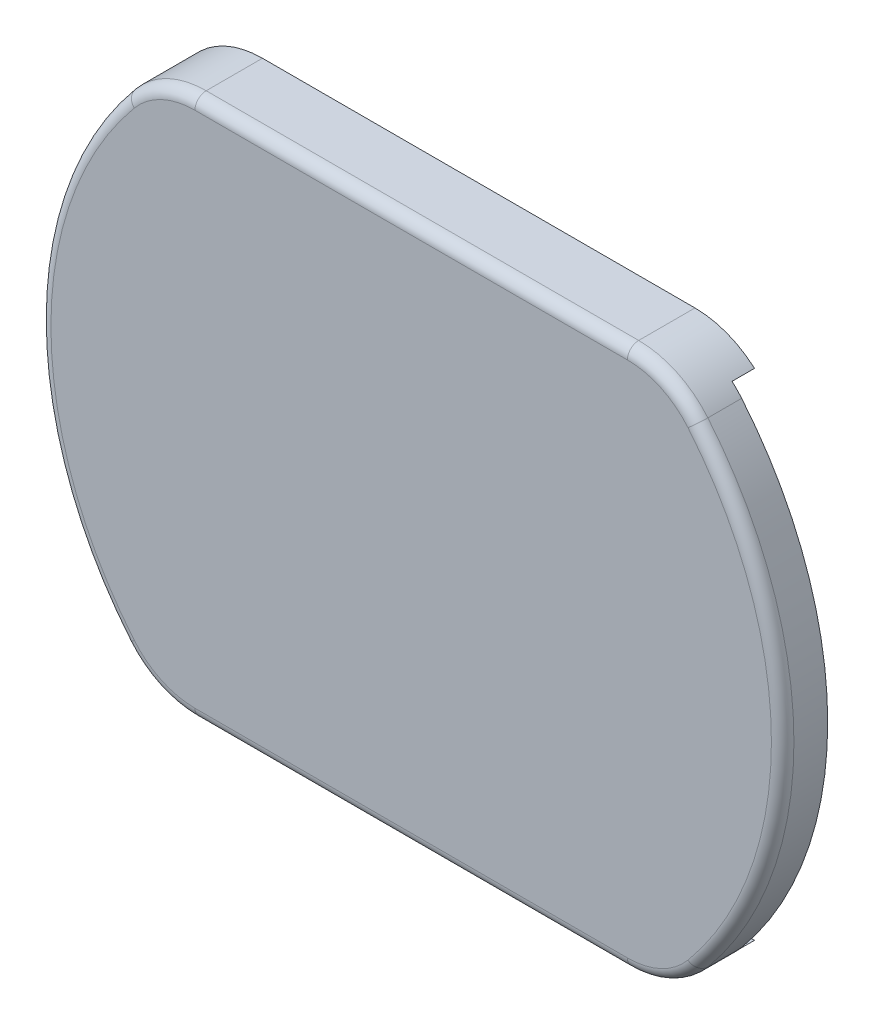
ISO-10303-21;
HEADER;
FILE_DESCRIPTION(('STEP AP214'),'2;1');
FILE_NAME('part.step','',(''),(''),'','','');
FILE_SCHEMA(('AUTOMOTIVE_DESIGN { 1 0 10303 214 1 1 1 1 }'));
ENDSEC;
DATA;
#1=APPLICATION_CONTEXT('core data for automotive mechanical design processes');
#2=APPLICATION_PROTOCOL_DEFINITION('international standard','automotive_design',2000,#1);
#3=PRODUCT_CONTEXT('',#1,'mechanical');
#4=PRODUCT('Part','Part','',(#3));
#5=PRODUCT_RELATED_PRODUCT_CATEGORY('part','',(#4));
#6=PRODUCT_DEFINITION_FORMATION('','',#4);
#7=PRODUCT_DEFINITION_CONTEXT('part definition',#1,'design');
#8=PRODUCT_DEFINITION('design','',#6,#7);
#9=PRODUCT_DEFINITION_SHAPE('','',#8);
#10=(LENGTH_UNIT() NAMED_UNIT(*) SI_UNIT(.MILLI.,.METRE.));
#11=(NAMED_UNIT(*) PLANE_ANGLE_UNIT() SI_UNIT($,.RADIAN.));
#12=(NAMED_UNIT(*) SI_UNIT($,.STERADIAN.) SOLID_ANGLE_UNIT());
#13=UNCERTAINTY_MEASURE_WITH_UNIT(LENGTH_MEASURE(1.E-05),#10,'distance_accuracy_value','');
#14=(GEOMETRIC_REPRESENTATION_CONTEXT(3) GLOBAL_UNCERTAINTY_ASSIGNED_CONTEXT((#13)) GLOBAL_UNIT_ASSIGNED_CONTEXT((#10,
#11,#12)) REPRESENTATION_CONTEXT('',''));
#15=CARTESIAN_POINT('',(0.,0.,0.));
#16=DIRECTION('',(0.,0.,1.));
#17=DIRECTION('',(1.,0.,0.));
#18=AXIS2_PLACEMENT_3D('',#15,#16,#17);
#19=CARTESIAN_POINT('',(9.60468635614927,8.,3.));
#20=DIRECTION('',(0.,0.,-1.));
#21=DIRECTION('',(-1.,0.,0.));
#22=AXIS2_PLACEMENT_3D('',#19,#20,#21);
#23=CYLINDRICAL_SURFACE('',#22,4.);
#24=DIRECTION('',(0.,0.,1.));
#25=VECTOR('',#24,1.);
#26=CARTESIAN_POINT('',(12.2504376672139,11.,0.));
#27=LINE('',#26,#25);
#28=CARTESIAN_POINT('',(12.2504376672139,11.,0.));
#29=VERTEX_POINT('',#28);
#30=CARTESIAN_POINT('',(12.2504376672139,11.,1.));
#31=VERTEX_POINT('',#30);
#32=EDGE_CURVE('E301',#29,#31,#27,.T.);
#33=ORIENTED_EDGE('',*,*,#32,.F.);
#34=CARTESIAN_POINT('',(9.60468635614927,8.,0.));
#35=DIRECTION('',(0.,0.,1.));
#36=DIRECTION('',(1.,0.,0.));
#37=AXIS2_PLACEMENT_3D('',#34,#35,#36);
#38=CIRCLE('',#37,4.);
#39=CARTESIAN_POINT('',(9.60468635614927,12.,0.));
#40=VERTEX_POINT('',#39);
#41=EDGE_CURVE('E325',#29,#40,#38,.T.);
#42=ORIENTED_EDGE('',*,*,#41,.T.);
#43=DIRECTION('',(0.,0.,-1.));
#44=VECTOR('',#43,1.);
#45=CARTESIAN_POINT('',(9.60468635614927,12.,3.));
#46=LINE('',#45,#44);
#47=CARTESIAN_POINT('',(9.60468635614927,12.,2.5));
#48=VERTEX_POINT('',#47);
#49=EDGE_CURVE('E342',#48,#40,#46,.T.);
#50=ORIENTED_EDGE('',*,*,#49,.F.);
#51=CARTESIAN_POINT('',(9.60468635614927,8.,2.5));
#52=DIRECTION('',(0.,0.,1.));
#53=DIRECTION('',(1.,0.,0.));
#54=AXIS2_PLACEMENT_3D('',#51,#52,#53);
#55=CIRCLE('',#54,4.);
#56=CARTESIAN_POINT('',(12.678185990117,10.56,2.5));
#57=VERTEX_POINT('',#56);
#58=EDGE_CURVE('E379',#48,#57,#55,.F.);
#59=ORIENTED_EDGE('',*,*,#58,.T.);
#60=DIRECTION('',(0.,0.,-1.));
#61=VECTOR('',#60,1.);
#62=CARTESIAN_POINT('',(12.678185990117,10.56,3.));
#63=LINE('',#62,#61);
#64=CARTESIAN_POINT('',(12.678185990117,10.56,1.));
#65=VERTEX_POINT('',#64);
#66=EDGE_CURVE('E345',#57,#65,#63,.T.);
#67=ORIENTED_EDGE('',*,*,#66,.T.);
#68=CARTESIAN_POINT('',(9.60468635614927,8.,1.));
#69=DIRECTION('',(0.,0.,1.));
#70=DIRECTION('',(1.,0.,0.));
#71=AXIS2_PLACEMENT_3D('',#68,#69,#70);
#72=CIRCLE('',#71,4.);
#73=EDGE_CURVE('E307',#65,#31,#72,.T.);
#74=ORIENTED_EDGE('',*,*,#73,.T.);
#75=EDGE_LOOP('',(#33,#42,#50,#59,#67,#74));
#76=FACE_BOUND('',#75,.T.);
#77=ADVANCED_FACE('F34',(#76),#23,.T.);
#78=CARTESIAN_POINT('',(-9.60468635614927,-8.,3.));
#79=DIRECTION('',(0.,0.,-1.));
#80=DIRECTION('',(-1.,0.,0.));
#81=AXIS2_PLACEMENT_3D('',#78,#79,#80);
#82=CYLINDRICAL_SURFACE('',#81,4.);
#83=DIRECTION('',(0.,0.,-1.));
#84=VECTOR('',#83,1.);
#85=CARTESIAN_POINT('',(-9.60468635614927,-12.,3.));
#86=LINE('',#85,#84);
#87=CARTESIAN_POINT('',(-9.60468635614927,-12.,2.5));
#88=VERTEX_POINT('',#87);
#89=CARTESIAN_POINT('',(-9.60468635614927,-12.,0.));
#90=VERTEX_POINT('',#89);
#91=EDGE_CURVE('E353',#88,#90,#86,.T.);
#92=ORIENTED_EDGE('',*,*,#91,.F.);
#93=CARTESIAN_POINT('',(-9.60468635614927,-8.,2.5));
#94=DIRECTION('',(0.,0.,1.));
#95=DIRECTION('',(1.,0.,0.));
#96=AXIS2_PLACEMENT_3D('',#93,#94,#95);
#97=CIRCLE('',#96,4.);
#98=CARTESIAN_POINT('',(-12.678185990117,-10.56,2.5));
#99=VERTEX_POINT('',#98);
#100=EDGE_CURVE('E11',#88,#99,#97,.F.);
#101=ORIENTED_EDGE('',*,*,#100,.T.);
#102=DIRECTION('',(0.,0.,-1.));
#103=VECTOR('',#102,1.);
#104=CARTESIAN_POINT('',(-12.678185990117,-10.56,3.));
#105=LINE('',#104,#103);
#106=CARTESIAN_POINT('',(-12.678185990117,-10.56,0.));
#107=VERTEX_POINT('',#106);
#108=EDGE_CURVE('E336',#99,#107,#105,.T.);
#109=ORIENTED_EDGE('',*,*,#108,.T.);
#110=CARTESIAN_POINT('',(-9.60468635614927,-8.,0.));
#111=DIRECTION('',(0.,0.,1.));
#112=DIRECTION('',(1.,0.,0.));
#113=AXIS2_PLACEMENT_3D('',#110,#111,#112);
#114=CIRCLE('',#113,4.);
#115=EDGE_CURVE('E316',#107,#90,#114,.T.);
#116=ORIENTED_EDGE('',*,*,#115,.T.);
#117=EDGE_LOOP('',(#92,#101,#109,#116));
#118=FACE_BOUND('',#117,.T.);
#119=ADVANCED_FACE('F464',(#118),#82,.T.);
#120=CARTESIAN_POINT('',(-9.60468635614927,-12.,3.));
#121=DIRECTION('',(0.,1.,0.));
#122=DIRECTION('',(-1.,0.,0.));
#123=AXIS2_PLACEMENT_3D('',#120,#121,#122);
#124=PLANE('',#123);
#125=DIRECTION('',(0.,0.,-1.));
#126=VECTOR('',#125,1.);
#127=CARTESIAN_POINT('',(9.60468635614927,-12.,3.));
#128=LINE('',#127,#126);
#129=CARTESIAN_POINT('',(9.60468635614927,-12.,2.5));
#130=VERTEX_POINT('',#129);
#131=CARTESIAN_POINT('',(9.60468635614927,-12.,0.));
#132=VERTEX_POINT('',#131);
#133=EDGE_CURVE('E351',#130,#132,#128,.T.);
#134=ORIENTED_EDGE('',*,*,#133,.F.);
#135=DIRECTION('',(1.,0.,0.));
#136=VECTOR('',#135,1.);
#137=CARTESIAN_POINT('',(-9.60468635614927,-12.,2.5));
#138=LINE('',#137,#136);
#139=EDGE_CURVE('E43',#130,#88,#138,.F.);
#140=ORIENTED_EDGE('',*,*,#139,.T.);
#141=ORIENTED_EDGE('',*,*,#91,.T.);
#142=DIRECTION('',(1.,0.,0.));
#143=VECTOR('',#142,1.);
#144=CARTESIAN_POINT('',(-9.60468635614927,-12.,0.));
#145=LINE('',#144,#143);
#146=EDGE_CURVE('E319',#90,#132,#145,.T.);
#147=ORIENTED_EDGE('',*,*,#146,.T.);
#148=EDGE_LOOP('',(#134,#140,#141,#147));
#149=FACE_BOUND('',#148,.T.);
#150=ADVANCED_FACE('F487',(#149),#124,.F.);
#151=CARTESIAN_POINT('',(9.60468635614927,-8.,3.));
#152=DIRECTION('',(0.,0.,-1.));
#153=DIRECTION('',(-1.,0.,0.));
#154=AXIS2_PLACEMENT_3D('',#151,#152,#153);
#155=CYLINDRICAL_SURFACE('',#154,4.);
#156=DIRECTION('',(0.,0.,1.));
#157=VECTOR('',#156,1.);
#158=CARTESIAN_POINT('',(12.2504376672139,-11.,0.));
#159=LINE('',#158,#157);
#160=CARTESIAN_POINT('',(12.2504376672139,-11.,0.));
#161=VERTEX_POINT('',#160);
#162=CARTESIAN_POINT('',(12.2504376672139,-11.,1.));
#163=VERTEX_POINT('',#162);
#164=EDGE_CURVE('E298',#161,#163,#159,.T.);
#165=ORIENTED_EDGE('',*,*,#164,.T.);
#166=CARTESIAN_POINT('',(9.60468635614927,-8.,1.));
#167=DIRECTION('',(0.,0.,1.));
#168=DIRECTION('',(1.,0.,0.));
#169=AXIS2_PLACEMENT_3D('',#166,#167,#168);
#170=CIRCLE('',#169,4.);
#171=CARTESIAN_POINT('',(12.678185990117,-10.56,1.));
#172=VERTEX_POINT('',#171);
#173=EDGE_CURVE('E310',#163,#172,#170,.T.);
#174=ORIENTED_EDGE('',*,*,#173,.T.);
#175=DIRECTION('',(0.,0.,-1.));
#176=VECTOR('',#175,1.);
#177=CARTESIAN_POINT('',(12.678185990117,-10.56,3.));
#178=LINE('',#177,#176);
#179=CARTESIAN_POINT('',(12.678185990117,-10.56,2.5));
#180=VERTEX_POINT('',#179);
#181=EDGE_CURVE('E348',#180,#172,#178,.T.);
#182=ORIENTED_EDGE('',*,*,#181,.F.);
#183=CARTESIAN_POINT('',(9.60468635614927,-8.,2.5));
#184=DIRECTION('',(0.,0.,1.));
#185=DIRECTION('',(1.,0.,0.));
#186=AXIS2_PLACEMENT_3D('',#183,#184,#185);
#187=CIRCLE('',#186,4.);
#188=EDGE_CURVE('E58',#180,#130,#187,.F.);
#189=ORIENTED_EDGE('',*,*,#188,.T.);
#190=ORIENTED_EDGE('',*,*,#133,.T.);
#191=CARTESIAN_POINT('',(9.60468635614927,-8.,0.));
#192=DIRECTION('',(0.,0.,1.));
#193=DIRECTION('',(1.,0.,0.));
#194=AXIS2_PLACEMENT_3D('',#191,#192,#193);
#195=CIRCLE('',#194,4.);
#196=EDGE_CURVE('E322',#132,#161,#195,.T.);
#197=ORIENTED_EDGE('',*,*,#196,.T.);
#198=EDGE_LOOP('',(#165,#174,#182,#189,#190,#197));
#199=FACE_BOUND('',#198,.T.);
#200=ADVANCED_FACE('F417',(#199),#155,.T.);
#201=CARTESIAN_POINT('',(0.,0.,3.));
#202=DIRECTION('',(0.,0.,-1.));
#203=DIRECTION('',(-1.,0.,0.));
#204=AXIS2_PLACEMENT_3D('',#201,#202,#203);
#205=CYLINDRICAL_SURFACE('',#204,16.5);
#206=ORIENTED_EDGE('',*,*,#181,.T.);
#207=CARTESIAN_POINT('',(0.,0.,1.));
#208=DIRECTION('',(0.,0.,1.));
#209=DIRECTION('',(1.,0.,0.));
#210=AXIS2_PLACEMENT_3D('',#207,#208,#209);
#211=CIRCLE('',#210,16.5);
#212=EDGE_CURVE('E297',#172,#65,#211,.T.);
#213=ORIENTED_EDGE('',*,*,#212,.T.);
#214=ORIENTED_EDGE('',*,*,#66,.F.);
#215=CARTESIAN_POINT('',(0.,0.,2.5));
#216=DIRECTION('',(0.,0.,1.));
#217=DIRECTION('',(1.,0.,0.));
#218=AXIS2_PLACEMENT_3D('',#215,#216,#217);
#219=CIRCLE('',#218,16.5);
#220=EDGE_CURVE('E381',#57,#180,#219,.F.);
#221=ORIENTED_EDGE('',*,*,#220,.T.);
#222=EDGE_LOOP('',(#206,#213,#214,#221));
#223=FACE_BOUND('',#222,.T.);
#224=ADVANCED_FACE('F416',(#223),#205,.T.);
#225=CARTESIAN_POINT('',(9.60468635614927,12.,3.));
#226=DIRECTION('',(0.,-1.,0.));
#227=DIRECTION('',(0.,0.,-1.));
#228=AXIS2_PLACEMENT_3D('',#225,#226,#227);
#229=PLANE('',#228);
#230=DIRECTION('',(0.,0.,-1.));
#231=VECTOR('',#230,1.);
#232=CARTESIAN_POINT('',(-9.60468635614927,12.,3.));
#233=LINE('',#232,#231);
#234=CARTESIAN_POINT('',(-9.60468635614927,12.,2.5));
#235=VERTEX_POINT('',#234);
#236=CARTESIAN_POINT('',(-9.60468635614927,12.,0.));
#237=VERTEX_POINT('',#236);
#238=EDGE_CURVE('E340',#235,#237,#233,.T.);
#239=ORIENTED_EDGE('',*,*,#238,.F.);
#240=DIRECTION('',(-1.,0.,0.));
#241=VECTOR('',#240,1.);
#242=CARTESIAN_POINT('',(9.60468635614927,12.,2.5));
#243=LINE('',#242,#241);
#244=EDGE_CURVE('E377',#235,#48,#243,.F.);
#245=ORIENTED_EDGE('',*,*,#244,.T.);
#246=ORIENTED_EDGE('',*,*,#49,.T.);
#247=DIRECTION('',(-1.,0.,0.));
#248=VECTOR('',#247,1.);
#249=CARTESIAN_POINT('',(9.60468635614927,12.,0.));
#250=LINE('',#249,#248);
#251=EDGE_CURVE('E327',#40,#237,#250,.T.);
#252=ORIENTED_EDGE('',*,*,#251,.T.);
#253=EDGE_LOOP('',(#239,#245,#246,#252));
#254=FACE_BOUND('',#253,.T.);
#255=ADVANCED_FACE('F428',(#254),#229,.F.);
#256=CARTESIAN_POINT('',(-9.60468635614927,8.,3.));
#257=DIRECTION('',(0.,0.,-1.));
#258=DIRECTION('',(-1.,0.,0.));
#259=AXIS2_PLACEMENT_3D('',#256,#257,#258);
#260=CYLINDRICAL_SURFACE('',#259,4.);
#261=DIRECTION('',(0.,0.,-1.));
#262=VECTOR('',#261,1.);
#263=CARTESIAN_POINT('',(-12.678185990117,10.56,3.));
#264=LINE('',#263,#262);
#265=CARTESIAN_POINT('',(-12.678185990117,10.56,2.5));
#266=VERTEX_POINT('',#265);
#267=CARTESIAN_POINT('',(-12.678185990117,10.56,0.));
#268=VERTEX_POINT('',#267);
#269=EDGE_CURVE('E338',#266,#268,#264,.T.);
#270=ORIENTED_EDGE('',*,*,#269,.F.);
#271=CARTESIAN_POINT('',(-9.60468635614927,8.,2.5));
#272=DIRECTION('',(0.,0.,1.));
#273=DIRECTION('',(1.,0.,0.));
#274=AXIS2_PLACEMENT_3D('',#271,#272,#273);
#275=CIRCLE('',#274,4.);
#276=EDGE_CURVE('E375',#266,#235,#275,.F.);
#277=ORIENTED_EDGE('',*,*,#276,.T.);
#278=ORIENTED_EDGE('',*,*,#238,.T.);
#279=CARTESIAN_POINT('',(-9.60468635614927,8.,0.));
#280=DIRECTION('',(0.,0.,1.));
#281=DIRECTION('',(1.,0.,0.));
#282=AXIS2_PLACEMENT_3D('',#279,#280,#281);
#283=CIRCLE('',#282,4.);
#284=EDGE_CURVE('E330',#237,#268,#283,.T.);
#285=ORIENTED_EDGE('',*,*,#284,.T.);
#286=EDGE_LOOP('',(#270,#277,#278,#285));
#287=FACE_BOUND('',#286,.T.);
#288=ADVANCED_FACE('F438',(#287),#260,.T.);
#289=CARTESIAN_POINT('',(0.,0.,3.));
#290=DIRECTION('',(0.,0.,-1.));
#291=DIRECTION('',(-1.,0.,0.));
#292=AXIS2_PLACEMENT_3D('',#289,#290,#291);
#293=CYLINDRICAL_SURFACE('',#292,16.5);
#294=ORIENTED_EDGE('',*,*,#108,.F.);
#295=CARTESIAN_POINT('',(0.,0.,2.5));
#296=DIRECTION('',(0.,0.,1.));
#297=DIRECTION('',(1.,0.,0.));
#298=AXIS2_PLACEMENT_3D('',#295,#296,#297);
#299=CIRCLE('',#298,16.5);
#300=EDGE_CURVE('E372',#99,#266,#299,.F.);
#301=ORIENTED_EDGE('',*,*,#300,.T.);
#302=ORIENTED_EDGE('',*,*,#269,.T.);
#303=CARTESIAN_POINT('',(0.,0.,0.));
#304=DIRECTION('',(0.,0.,1.));
#305=DIRECTION('',(1.,0.,0.));
#306=AXIS2_PLACEMENT_3D('',#303,#304,#305);
#307=CIRCLE('',#306,16.5);
#308=EDGE_CURVE('E333',#268,#107,#307,.T.);
#309=ORIENTED_EDGE('',*,*,#308,.T.);
#310=EDGE_LOOP('',(#294,#301,#302,#309));
#311=FACE_BOUND('',#310,.T.);
#312=ADVANCED_FACE('F467',(#311),#293,.T.);
#313=CARTESIAN_POINT('',(-9.60468635614927,-8.,3.));
#314=DIRECTION('',(0.,0.,1.));
#315=DIRECTION('',(1.,0.,0.));
#316=AXIS2_PLACEMENT_3D('',#313,#314,#315);
#317=PLANE('',#316);
#318=CARTESIAN_POINT('',(-9.60468635614927,8.,3.));
#319=DIRECTION('',(0.,0.,1.));
#320=DIRECTION('',(1.,0.,0.));
#321=AXIS2_PLACEMENT_3D('',#318,#319,#320);
#322=CIRCLE('',#321,3.5);
#323=CARTESIAN_POINT('',(-9.60468635614927,11.5,3.));
#324=VERTEX_POINT('',#323);
#325=CARTESIAN_POINT('',(-12.2939985358711,10.24,3.));
#326=VERTEX_POINT('',#325);
#327=EDGE_CURVE('E367',#324,#326,#322,.T.);
#328=ORIENTED_EDGE('',*,*,#327,.T.);
#329=CARTESIAN_POINT('',(0.,0.,3.));
#330=DIRECTION('',(0.,0.,1.));
#331=DIRECTION('',(1.,0.,0.));
#332=AXIS2_PLACEMENT_3D('',#329,#330,#331);
#333=CIRCLE('',#332,16.);
#334=CARTESIAN_POINT('',(-12.2939985358711,-10.24,3.));
#335=VERTEX_POINT('',#334);
#336=EDGE_CURVE('E369',#326,#335,#333,.T.);
#337=ORIENTED_EDGE('',*,*,#336,.T.);
#338=CARTESIAN_POINT('',(-9.60468635614927,-8.,3.));
#339=DIRECTION('',(0.,0.,1.));
#340=DIRECTION('',(1.,0.,0.));
#341=AXIS2_PLACEMENT_3D('',#338,#339,#340);
#342=CIRCLE('',#341,3.5);
#343=CARTESIAN_POINT('',(-9.60468635614927,-11.5,3.));
#344=VERTEX_POINT('',#343);
#345=EDGE_CURVE('E355',#335,#344,#342,.T.);
#346=ORIENTED_EDGE('',*,*,#345,.T.);
#347=DIRECTION('',(1.,0.,0.));
#348=VECTOR('',#347,1.);
#349=CARTESIAN_POINT('',(9.60468635614927,-11.5,3.));
#350=LINE('',#349,#348);
#351=CARTESIAN_POINT('',(9.60468635614927,-11.5,3.));
#352=VERTEX_POINT('',#351);
#353=EDGE_CURVE('E357',#344,#352,#350,.T.);
#354=ORIENTED_EDGE('',*,*,#353,.T.);
#355=CARTESIAN_POINT('',(9.60468635614927,-8.,3.));
#356=DIRECTION('',(0.,0.,1.));
#357=DIRECTION('',(1.,0.,0.));
#358=AXIS2_PLACEMENT_3D('',#355,#356,#357);
#359=CIRCLE('',#358,3.5);
#360=CARTESIAN_POINT('',(12.2939985358711,-10.24,3.));
#361=VERTEX_POINT('',#360);
#362=EDGE_CURVE('E359',#352,#361,#359,.T.);
#363=ORIENTED_EDGE('',*,*,#362,.T.);
#364=CARTESIAN_POINT('',(0.,0.,3.));
#365=DIRECTION('',(0.,0.,1.));
#366=DIRECTION('',(1.,0.,0.));
#367=AXIS2_PLACEMENT_3D('',#364,#365,#366);
#368=CIRCLE('',#367,16.);
#369=CARTESIAN_POINT('',(12.2939985358711,10.24,3.));
#370=VERTEX_POINT('',#369);
#371=EDGE_CURVE('E361',#361,#370,#368,.T.);
#372=ORIENTED_EDGE('',*,*,#371,.T.);
#373=CARTESIAN_POINT('',(9.60468635614927,8.,3.));
#374=DIRECTION('',(0.,0.,1.));
#375=DIRECTION('',(1.,0.,0.));
#376=AXIS2_PLACEMENT_3D('',#373,#374,#375);
#377=CIRCLE('',#376,3.5);
#378=CARTESIAN_POINT('',(9.60468635614927,11.5,3.));
#379=VERTEX_POINT('',#378);
#380=EDGE_CURVE('E363',#370,#379,#377,.T.);
#381=ORIENTED_EDGE('',*,*,#380,.T.);
#382=DIRECTION('',(-1.,0.,0.));
#383=VECTOR('',#382,1.);
#384=CARTESIAN_POINT('',(-9.60468635614927,11.5,3.));
#385=LINE('',#384,#383);
#386=EDGE_CURVE('E365',#379,#324,#385,.T.);
#387=ORIENTED_EDGE('',*,*,#386,.T.);
#388=EDGE_LOOP('',(#328,#337,#346,#354,#363,#372,#381,#387));
#389=FACE_BOUND('',#388,.T.);
#390=ADVANCED_FACE('F450',(#389),#317,.T.);
#391=CARTESIAN_POINT('',(-9.60468635614927,-8.,0.));
#392=DIRECTION('',(0.,0.,1.));
#393=DIRECTION('',(1.,0.,0.));
#394=AXIS2_PLACEMENT_3D('',#391,#392,#393);
#395=PLANE('',#394);
#396=CARTESIAN_POINT('',(-9.60468635614927,-8.,0.));
#397=DIRECTION('',(0.,0.,-1.));
#398=DIRECTION('',(-1.,0.,0.));
#399=AXIS2_PLACEMENT_3D('',#396,#397,#398);
#400=CIRCLE('',#399,2.5);
#401=CARTESIAN_POINT('',(-9.60468635614927,-10.5,0.));
#402=VERTEX_POINT('',#401);
#403=CARTESIAN_POINT('',(-11.5256236273791,-9.6,0.));
#404=VERTEX_POINT('',#403);
#405=EDGE_CURVE('E788',#402,#404,#400,.T.);
#406=ORIENTED_EDGE('',*,*,#405,.F.);
#407=DIRECTION('',(1.,0.,0.));
#408=VECTOR('',#407,1.);
#409=CARTESIAN_POINT('',(-9.5,-10.5,0.));
#410=LINE('',#409,#408);
#411=CARTESIAN_POINT('',(10.5,-10.5,0.));
#412=VERTEX_POINT('',#411);
#413=EDGE_CURVE('E234',#402,#412,#410,.T.);
#414=ORIENTED_EDGE('',*,*,#413,.T.);
#415=DIRECTION('',(0.,-1.,0.));
#416=VECTOR('',#415,1.);
#417=CARTESIAN_POINT('',(10.5,-10.5,0.));
#418=LINE('',#417,#416);
#419=CARTESIAN_POINT('',(10.5,-11.,0.));
#420=VERTEX_POINT('',#419);
#421=EDGE_CURVE('E271',#412,#420,#418,.T.);
#422=ORIENTED_EDGE('',*,*,#421,.T.);
#423=DIRECTION('',(-1.,0.,0.));
#424=VECTOR('',#423,1.);
#425=CARTESIAN_POINT('',(-8.5,-11.,0.));
#426=LINE('',#425,#424);
#427=EDGE_CURVE('E285',#161,#420,#426,.T.);
#428=ORIENTED_EDGE('',*,*,#427,.F.);
#429=ORIENTED_EDGE('',*,*,#196,.F.);
#430=ORIENTED_EDGE('',*,*,#146,.F.);
#431=ORIENTED_EDGE('',*,*,#115,.F.);
#432=ORIENTED_EDGE('',*,*,#308,.F.);
#433=ORIENTED_EDGE('',*,*,#284,.F.);
#434=ORIENTED_EDGE('',*,*,#251,.F.);
#435=ORIENTED_EDGE('',*,*,#41,.F.);
#436=DIRECTION('',(1.,0.,0.));
#437=VECTOR('',#436,1.);
#438=CARTESIAN_POINT('',(12.2504376672139,11.,0.));
#439=LINE('',#438,#437);
#440=CARTESIAN_POINT('',(10.5,11.,0.));
#441=VERTEX_POINT('',#440);
#442=EDGE_CURVE('E283',#441,#29,#439,.T.);
#443=ORIENTED_EDGE('',*,*,#442,.F.);
#444=DIRECTION('',(0.,1.,0.));
#445=VECTOR('',#444,1.);
#446=CARTESIAN_POINT('',(10.5,10.5,0.));
#447=LINE('',#446,#445);
#448=CARTESIAN_POINT('',(10.5,10.5,0.));
#449=VERTEX_POINT('',#448);
#450=EDGE_CURVE('E258',#449,#441,#447,.T.);
#451=ORIENTED_EDGE('',*,*,#450,.F.);
#452=DIRECTION('',(1.,0.,0.));
#453=VECTOR('',#452,1.);
#454=CARTESIAN_POINT('',(-9.5,10.5,0.));
#455=LINE('',#454,#453);
#456=CARTESIAN_POINT('',(-9.60468635614927,10.5,0.));
#457=VERTEX_POINT('',#456);
#458=EDGE_CURVE('E251',#457,#449,#455,.T.);
#459=ORIENTED_EDGE('',*,*,#458,.F.);
#460=CARTESIAN_POINT('',(-9.60468635614927,8.,0.));
#461=DIRECTION('',(0.,0.,-1.));
#462=DIRECTION('',(-1.,0.,0.));
#463=AXIS2_PLACEMENT_3D('',#460,#461,#462);
#464=CIRCLE('',#463,2.5);
#465=CARTESIAN_POINT('',(-11.5256236273791,9.60000000000001,0.));
#466=VERTEX_POINT('',#465);
#467=EDGE_CURVE('E221',#466,#457,#464,.T.);
#468=ORIENTED_EDGE('',*,*,#467,.F.);
#469=CARTESIAN_POINT('',(0.,0.,0.));
#470=DIRECTION('',(0.,0.,-1.));
#471=DIRECTION('',(-1.,0.,0.));
#472=AXIS2_PLACEMENT_3D('',#469,#470,#471);
#473=CIRCLE('',#472,15.);
#474=EDGE_CURVE('E787',#404,#466,#473,.T.);
#475=ORIENTED_EDGE('',*,*,#474,.F.);
#476=EDGE_LOOP('',(#406,#414,#422,#428,#429,#430,#431,#432,#433,#434,#435,#443,#451,#459,#468,#475));
#477=FACE_BOUND('',#476,.T.);
#478=ADVANCED_FACE('F432',(#477),#395,.F.);
#479=CARTESIAN_POINT('',(0.,0.,2.5));
#480=DIRECTION('',(0.,0.,1.));
#481=DIRECTION('',(1.,0.,0.));
#482=AXIS2_PLACEMENT_3D('',#479,#480,#481);
#483=TOROIDAL_SURFACE('',#482,16.,0.5);
#484=CARTESIAN_POINT('',(12.2939985358711,-10.24,2.5));
#485=DIRECTION('',(-0.640000000000002,-0.76837490849194,0.));
#486=DIRECTION('',(0.76837490849194,-0.640000000000002,0.));
#487=AXIS2_PLACEMENT_3D('',#484,#485,#486);
#488=CIRCLE('',#487,0.5);
#489=EDGE_CURVE('E399',#180,#361,#488,.T.);
#490=ORIENTED_EDGE('',*,*,#489,.F.);
#491=ORIENTED_EDGE('',*,*,#220,.F.);
#492=CARTESIAN_POINT('',(12.2939985358711,10.24,2.5));
#493=DIRECTION('',(-0.640000000000001,0.768374908491941,0.));
#494=DIRECTION('',(-0.768374908491941,-0.640000000000002,0.));
#495=AXIS2_PLACEMENT_3D('',#492,#493,#494);
#496=CIRCLE('',#495,0.5);
#497=EDGE_CURVE('E38',#370,#57,#496,.T.);
#498=ORIENTED_EDGE('',*,*,#497,.F.);
#499=ORIENTED_EDGE('',*,*,#371,.F.);
#500=EDGE_LOOP('',(#490,#491,#498,#499));
#501=FACE_BOUND('',#500,.T.);
#502=ADVANCED_FACE('F36',(#501),#483,.T.);
#503=CARTESIAN_POINT('',(9.60468635614927,8.,2.5));
#504=DIRECTION('',(0.,0.,1.));
#505=DIRECTION('',(1.,0.,0.));
#506=AXIS2_PLACEMENT_3D('',#503,#504,#505);
#507=TOROIDAL_SURFACE('',#506,3.5,0.5);
#508=ORIENTED_EDGE('',*,*,#497,.T.);
#509=ORIENTED_EDGE('',*,*,#58,.F.);
#510=CARTESIAN_POINT('',(9.60468635614927,11.5,2.5));
#511=DIRECTION('',(-1.,0.,0.));
#512=DIRECTION('',(0.,0.,1.));
#513=AXIS2_PLACEMENT_3D('',#510,#511,#512);
#514=CIRCLE('',#513,0.5);
#515=EDGE_CURVE('E397',#379,#48,#514,.T.);
#516=ORIENTED_EDGE('',*,*,#515,.F.);
#517=ORIENTED_EDGE('',*,*,#380,.F.);
#518=EDGE_LOOP('',(#508,#509,#516,#517));
#519=FACE_BOUND('',#518,.T.);
#520=ADVANCED_FACE('F409',(#519),#507,.T.);
#521=CARTESIAN_POINT('',(9.60468635614927,-8.,2.5));
#522=DIRECTION('',(0.,0.,1.));
#523=DIRECTION('',(1.,0.,0.));
#524=AXIS2_PLACEMENT_3D('',#521,#522,#523);
#525=TOROIDAL_SURFACE('',#524,3.5,0.5);
#526=ORIENTED_EDGE('',*,*,#489,.T.);
#527=ORIENTED_EDGE('',*,*,#362,.F.);
#528=CARTESIAN_POINT('',(9.60468635614927,-11.5,2.5));
#529=DIRECTION('',(-1.,0.,0.));
#530=DIRECTION('',(0.,0.,1.));
#531=AXIS2_PLACEMENT_3D('',#528,#529,#530);
#532=CIRCLE('',#531,0.5);
#533=EDGE_CURVE('E394',#130,#352,#532,.T.);
#534=ORIENTED_EDGE('',*,*,#533,.F.);
#535=ORIENTED_EDGE('',*,*,#188,.F.);
#536=EDGE_LOOP('',(#526,#527,#534,#535));
#537=FACE_BOUND('',#536,.T.);
#538=ADVANCED_FACE('F453',(#537),#525,.T.);
#539=CARTESIAN_POINT('',(-9.60468635614927,11.5,2.5));
#540=DIRECTION('',(1.,0.,0.));
#541=DIRECTION('',(0.,0.,-1.));
#542=AXIS2_PLACEMENT_3D('',#539,#540,#541);
#543=CYLINDRICAL_SURFACE('',#542,0.5);
#544=ORIENTED_EDGE('',*,*,#515,.T.);
#545=ORIENTED_EDGE('',*,*,#244,.F.);
#546=CARTESIAN_POINT('',(-9.60468635614927,11.5,2.5));
#547=DIRECTION('',(-1.,0.,0.));
#548=DIRECTION('',(0.,0.,1.));
#549=AXIS2_PLACEMENT_3D('',#546,#547,#548);
#550=CIRCLE('',#549,0.5);
#551=EDGE_CURVE('E391',#324,#235,#550,.T.);
#552=ORIENTED_EDGE('',*,*,#551,.F.);
#553=ORIENTED_EDGE('',*,*,#386,.F.);
#554=EDGE_LOOP('',(#544,#545,#552,#553));
#555=FACE_BOUND('',#554,.T.);
#556=ADVANCED_FACE('F442',(#555),#543,.T.);
#557=CARTESIAN_POINT('',(-9.60468635614927,-11.5,2.5));
#558=DIRECTION('',(-1.,0.,0.));
#559=DIRECTION('',(0.,-1.,0.));
#560=AXIS2_PLACEMENT_3D('',#557,#558,#559);
#561=CYLINDRICAL_SURFACE('',#560,0.5);
#562=ORIENTED_EDGE('',*,*,#533,.T.);
#563=ORIENTED_EDGE('',*,*,#353,.F.);
#564=CARTESIAN_POINT('',(-9.60468635614927,-11.5,2.5));
#565=DIRECTION('',(-1.,0.,0.));
#566=DIRECTION('',(0.,0.,1.));
#567=AXIS2_PLACEMENT_3D('',#564,#565,#566);
#568=CIRCLE('',#567,0.5);
#569=EDGE_CURVE('E388',#88,#344,#568,.T.);
#570=ORIENTED_EDGE('',*,*,#569,.F.);
#571=ORIENTED_EDGE('',*,*,#139,.F.);
#572=EDGE_LOOP('',(#562,#563,#570,#571));
#573=FACE_BOUND('',#572,.T.);
#574=ADVANCED_FACE('F455',(#573),#561,.T.);
#575=CARTESIAN_POINT('',(-9.60468635614927,8.,2.5));
#576=DIRECTION('',(0.,0.,1.));
#577=DIRECTION('',(1.,0.,0.));
#578=AXIS2_PLACEMENT_3D('',#575,#576,#577);
#579=TOROIDAL_SURFACE('',#578,3.5,0.5);
#580=ORIENTED_EDGE('',*,*,#551,.T.);
#581=ORIENTED_EDGE('',*,*,#276,.F.);
#582=CARTESIAN_POINT('',(-12.2939985358711,10.24,2.5));
#583=DIRECTION('',(-0.640000000000002,-0.76837490849194,0.));
#584=DIRECTION('',(0.76837490849194,-0.640000000000002,0.));
#585=AXIS2_PLACEMENT_3D('',#582,#583,#584);
#586=CIRCLE('',#585,0.5);
#587=EDGE_CURVE('E386',#326,#266,#586,.T.);
#588=ORIENTED_EDGE('',*,*,#587,.F.);
#589=ORIENTED_EDGE('',*,*,#327,.F.);
#590=EDGE_LOOP('',(#580,#581,#588,#589));
#591=FACE_BOUND('',#590,.T.);
#592=ADVANCED_FACE('F446',(#591),#579,.T.);
#593=CARTESIAN_POINT('',(-9.60468635614927,-8.,2.5));
#594=DIRECTION('',(0.,0.,1.));
#595=DIRECTION('',(1.,0.,0.));
#596=AXIS2_PLACEMENT_3D('',#593,#594,#595);
#597=TOROIDAL_SURFACE('',#596,3.5,0.5);
#598=ORIENTED_EDGE('',*,*,#569,.T.);
#599=ORIENTED_EDGE('',*,*,#345,.F.);
#600=CARTESIAN_POINT('',(-12.2939985358711,-10.24,2.5));
#601=DIRECTION('',(-0.639999999999998,0.768374908491943,0.));
#602=DIRECTION('',(-0.768374908491943,-0.639999999999998,0.));
#603=AXIS2_PLACEMENT_3D('',#600,#601,#602);
#604=CIRCLE('',#603,0.5);
#605=EDGE_CURVE('E315',#99,#335,#604,.T.);
#606=ORIENTED_EDGE('',*,*,#605,.F.);
#607=ORIENTED_EDGE('',*,*,#100,.F.);
#608=EDGE_LOOP('',(#598,#599,#606,#607));
#609=FACE_BOUND('',#608,.T.);
#610=ADVANCED_FACE('F461',(#609),#597,.T.);
#611=CARTESIAN_POINT('',(0.,0.,2.5));
#612=DIRECTION('',(0.,0.,1.));
#613=DIRECTION('',(1.,0.,0.));
#614=AXIS2_PLACEMENT_3D('',#611,#612,#613);
#615=TOROIDAL_SURFACE('',#614,16.,0.5);
#616=ORIENTED_EDGE('',*,*,#587,.T.);
#617=ORIENTED_EDGE('',*,*,#300,.F.);
#618=ORIENTED_EDGE('',*,*,#605,.T.);
#619=ORIENTED_EDGE('',*,*,#336,.F.);
#620=EDGE_LOOP('',(#616,#617,#618,#619));
#621=FACE_BOUND('',#620,.T.);
#622=ADVANCED_FACE('F469',(#621),#615,.T.);
#623=CARTESIAN_POINT('',(12.2504376672139,11.,0.));
#624=DIRECTION('',(0.,-1.,0.));
#625=DIRECTION('',(1.,0.,0.));
#626=AXIS2_PLACEMENT_3D('',#623,#624,#625);
#627=PLANE('',#626);
#628=DIRECTION('',(0.,0.,1.));
#629=VECTOR('',#628,1.);
#630=CARTESIAN_POINT('',(10.5,11.,0.));
#631=LINE('',#630,#629);
#632=CARTESIAN_POINT('',(10.5,11.,0.750000000000001));
#633=VERTEX_POINT('',#632);
#634=EDGE_CURVE('E249',#441,#633,#631,.T.);
#635=ORIENTED_EDGE('',*,*,#634,.F.);
#636=ORIENTED_EDGE('',*,*,#442,.T.);
#637=ORIENTED_EDGE('',*,*,#32,.T.);
#638=DIRECTION('',(1.,0.,0.));
#639=VECTOR('',#638,1.);
#640=CARTESIAN_POINT('',(12.2504376672139,11.,1.));
#641=LINE('',#640,#639);
#642=CARTESIAN_POINT('',(-8.5,11.,1.));
#643=VERTEX_POINT('',#642);
#644=EDGE_CURVE('E290',#643,#31,#641,.T.);
#645=ORIENTED_EDGE('',*,*,#644,.F.);
#646=DIRECTION('',(0.,0.,1.));
#647=VECTOR('',#646,1.);
#648=CARTESIAN_POINT('',(-8.5,11.,0.));
#649=LINE('',#648,#647);
#650=CARTESIAN_POINT('',(-8.5,11.,0.750000000000001));
#651=VERTEX_POINT('',#650);
#652=EDGE_CURVE('E288',#651,#643,#649,.T.);
#653=ORIENTED_EDGE('',*,*,#652,.F.);
#654=DIRECTION('',(-1.,0.,0.));
#655=VECTOR('',#654,1.);
#656=CARTESIAN_POINT('',(-9.5,11.,0.750000000000001));
#657=LINE('',#656,#655);
#658=EDGE_CURVE('E244',#633,#651,#657,.T.);
#659=ORIENTED_EDGE('',*,*,#658,.F.);
#660=EDGE_LOOP('',(#635,#636,#637,#645,#653,#659));
#661=FACE_BOUND('',#660,.T.);
#662=ADVANCED_FACE('F471',(#661),#627,.T.);
#663=CARTESIAN_POINT('',(-8.5,10.,0.));
#664=DIRECTION('',(0.,0.,1.));
#665=DIRECTION('',(1.,0.,0.));
#666=AXIS2_PLACEMENT_3D('',#663,#664,#665);
#667=CYLINDRICAL_SURFACE('',#666,1.);
#668=DIRECTION('',(0.,0.,1.));
#669=VECTOR('',#668,1.);
#670=CARTESIAN_POINT('',(-9.36602540378444,10.5,0.));
#671=LINE('',#670,#669);
#672=CARTESIAN_POINT('',(-9.36602540378444,10.5,0.750000000000001));
#673=VERTEX_POINT('',#672);
#674=CARTESIAN_POINT('',(-9.36602540378444,10.5,1.));
#675=VERTEX_POINT('',#674);
#676=EDGE_CURVE('E239',#673,#675,#671,.T.);
#677=ORIENTED_EDGE('',*,*,#676,.F.);
#678=CARTESIAN_POINT('',(-8.5,10.,0.750000000000001));
#679=DIRECTION('',(0.,0.,-1.));
#680=DIRECTION('',(-1.,0.,0.));
#681=AXIS2_PLACEMENT_3D('',#678,#679,#680);
#682=CIRCLE('',#681,1.);
#683=EDGE_CURVE('E313',#673,#651,#682,.T.);
#684=ORIENTED_EDGE('',*,*,#683,.T.);
#685=ORIENTED_EDGE('',*,*,#652,.T.);
#686=CARTESIAN_POINT('',(-8.5,10.,1.));
#687=DIRECTION('',(0.,0.,-1.));
#688=DIRECTION('',(1.,0.,0.));
#689=AXIS2_PLACEMENT_3D('',#686,#687,#688);
#690=CIRCLE('',#689,1.);
#691=EDGE_CURVE('E282',#675,#643,#690,.T.);
#692=ORIENTED_EDGE('',*,*,#691,.F.);
#693=EDGE_LOOP('',(#677,#684,#685,#692));
#694=FACE_BOUND('',#693,.T.);
#695=ADVANCED_FACE('F477',(#694),#667,.F.);
#696=CARTESIAN_POINT('',(0.,0.,1.));
#697=DIRECTION('',(0.,0.,1.));
#698=DIRECTION('',(1.,0.,0.));
#699=AXIS2_PLACEMENT_3D('',#696,#697,#698);
#700=PLANE('',#699);
#701=DIRECTION('',(1.,0.,0.));
#702=VECTOR('',#701,1.);
#703=CARTESIAN_POINT('',(-9.60468635614927,10.5,1.));
#704=LINE('',#703,#702);
#705=CARTESIAN_POINT('',(-9.60468635614927,10.5,1.));
#706=VERTEX_POINT('',#705);
#707=EDGE_CURVE('E242',#706,#675,#704,.T.);
#708=ORIENTED_EDGE('',*,*,#707,.T.);
#709=ORIENTED_EDGE('',*,*,#691,.T.);
#710=ORIENTED_EDGE('',*,*,#644,.T.);
#711=ORIENTED_EDGE('',*,*,#73,.F.);
#712=ORIENTED_EDGE('',*,*,#212,.F.);
#713=ORIENTED_EDGE('',*,*,#173,.F.);
#714=DIRECTION('',(-1.,0.,0.));
#715=VECTOR('',#714,1.);
#716=CARTESIAN_POINT('',(-8.5,-11.,1.));
#717=LINE('',#716,#715);
#718=CARTESIAN_POINT('',(-8.5,-11.,1.));
#719=VERTEX_POINT('',#718);
#720=EDGE_CURVE('E292',#163,#719,#717,.T.);
#721=ORIENTED_EDGE('',*,*,#720,.T.);
#722=CARTESIAN_POINT('',(-8.5,-10.,1.));
#723=DIRECTION('',(0.,0.,-1.));
#724=DIRECTION('',(-1.,0.,0.));
#725=AXIS2_PLACEMENT_3D('',#722,#723,#724);
#726=CIRCLE('',#725,1.);
#727=CARTESIAN_POINT('',(-9.36602540378444,-10.5,1.));
#728=VERTEX_POINT('',#727);
#729=EDGE_CURVE('E216',#719,#728,#726,.T.);
#730=ORIENTED_EDGE('',*,*,#729,.T.);
#731=DIRECTION('',(-1.,0.,0.));
#732=VECTOR('',#731,1.);
#733=CARTESIAN_POINT('',(-9.60468635614927,-10.5,1.));
#734=LINE('',#733,#732);
#735=CARTESIAN_POINT('',(-9.60468635614927,-10.5,1.));
#736=VERTEX_POINT('',#735);
#737=EDGE_CURVE('E208',#728,#736,#734,.T.);
#738=ORIENTED_EDGE('',*,*,#737,.T.);
#739=CARTESIAN_POINT('',(-9.60468635614927,-8.,1.));
#740=DIRECTION('',(0.,0.,1.));
#741=DIRECTION('',(1.,0.,0.));
#742=AXIS2_PLACEMENT_3D('',#739,#740,#741);
#743=CIRCLE('',#742,2.5);
#744=CARTESIAN_POINT('',(-11.5256236273791,-9.6,1.));
#745=VERTEX_POINT('',#744);
#746=EDGE_CURVE('E213',#736,#745,#743,.F.);
#747=ORIENTED_EDGE('',*,*,#746,.T.);
#748=CARTESIAN_POINT('',(0.,0.,1.));
#749=DIRECTION('',(0.,0.,1.));
#750=DIRECTION('',(1.,0.,0.));
#751=AXIS2_PLACEMENT_3D('',#748,#749,#750);
#752=CIRCLE('',#751,15.);
#753=CARTESIAN_POINT('',(-11.5256236273791,9.60000000000001,1.));
#754=VERTEX_POINT('',#753);
#755=EDGE_CURVE('E781',#745,#754,#752,.F.);
#756=ORIENTED_EDGE('',*,*,#755,.T.);
#757=CARTESIAN_POINT('',(-9.60468635614927,8.,1.));
#758=DIRECTION('',(0.,0.,1.));
#759=DIRECTION('',(1.,0.,0.));
#760=AXIS2_PLACEMENT_3D('',#757,#758,#759);
#761=CIRCLE('',#760,2.5);
#762=EDGE_CURVE('E771',#754,#706,#761,.F.);
#763=ORIENTED_EDGE('',*,*,#762,.T.);
#764=EDGE_LOOP('',(#708,#709,#710,#711,#712,#713,#721,#730,#738,#747,#756,#763));
#765=FACE_BOUND('',#764,.T.);
#766=ADVANCED_FACE('F211',(#765),#700,.F.);
#767=CARTESIAN_POINT('',(-8.5,-10.,0.));
#768=DIRECTION('',(0.,0.,1.));
#769=DIRECTION('',(1.,0.,0.));
#770=AXIS2_PLACEMENT_3D('',#767,#768,#769);
#771=CYLINDRICAL_SURFACE('',#770,1.);
#772=DIRECTION('',(0.,0.,1.));
#773=VECTOR('',#772,1.);
#774=CARTESIAN_POINT('',(-9.36602540378444,-10.5,0.));
#775=LINE('',#774,#773);
#776=CARTESIAN_POINT('',(-9.36602540378444,-10.5,0.750000000000001));
#777=VERTEX_POINT('',#776);
#778=EDGE_CURVE('E241',#728,#777,#775,.F.);
#779=ORIENTED_EDGE('',*,*,#778,.F.);
#780=ORIENTED_EDGE('',*,*,#729,.F.);
#781=DIRECTION('',(0.,0.,1.));
#782=VECTOR('',#781,1.);
#783=CARTESIAN_POINT('',(-8.5,-11.,0.));
#784=LINE('',#783,#782);
#785=CARTESIAN_POINT('',(-8.5,-11.,0.750000000000001));
#786=VERTEX_POINT('',#785);
#787=EDGE_CURVE('E295',#786,#719,#784,.T.);
#788=ORIENTED_EDGE('',*,*,#787,.F.);
#789=CARTESIAN_POINT('',(-8.5,-10.,0.750000000000001));
#790=DIRECTION('',(0.,0.,1.));
#791=DIRECTION('',(1.,0.,0.));
#792=AXIS2_PLACEMENT_3D('',#789,#790,#791);
#793=CIRCLE('',#792,1.);
#794=EDGE_CURVE('E277',#777,#786,#793,.T.);
#795=ORIENTED_EDGE('',*,*,#794,.F.);
#796=EDGE_LOOP('',(#779,#780,#788,#795));
#797=FACE_BOUND('',#796,.T.);
#798=ADVANCED_FACE('F507',(#797),#771,.F.);
#799=CARTESIAN_POINT('',(-8.5,-11.,0.));
#800=DIRECTION('',(0.,1.,0.));
#801=DIRECTION('',(0.,0.,1.));
#802=AXIS2_PLACEMENT_3D('',#799,#800,#801);
#803=PLANE('',#802);
#804=ORIENTED_EDGE('',*,*,#787,.T.);
#805=ORIENTED_EDGE('',*,*,#720,.F.);
#806=ORIENTED_EDGE('',*,*,#164,.F.);
#807=ORIENTED_EDGE('',*,*,#427,.T.);
#808=DIRECTION('',(0.,0.,1.));
#809=VECTOR('',#808,1.);
#810=CARTESIAN_POINT('',(10.5,-11.,0.));
#811=LINE('',#810,#809);
#812=CARTESIAN_POINT('',(10.5,-11.,0.750000000000001));
#813=VERTEX_POINT('',#812);
#814=EDGE_CURVE('E261',#420,#813,#811,.T.);
#815=ORIENTED_EDGE('',*,*,#814,.T.);
#816=DIRECTION('',(-1.,0.,0.));
#817=VECTOR('',#816,1.);
#818=CARTESIAN_POINT('',(-9.5,-11.,0.750000000000001));
#819=LINE('',#818,#817);
#820=EDGE_CURVE('E265',#813,#786,#819,.T.);
#821=ORIENTED_EDGE('',*,*,#820,.T.);
#822=EDGE_LOOP('',(#804,#805,#806,#807,#815,#821));
#823=FACE_BOUND('',#822,.T.);
#824=ADVANCED_FACE('F502',(#823),#803,.T.);
#825=CARTESIAN_POINT('',(-9.5,-10.5,0.750000000000001));
#826=DIRECTION('',(0.,0.,1.));
#827=DIRECTION('',(1.,0.,0.));
#828=AXIS2_PLACEMENT_3D('',#825,#826,#827);
#829=PLANE('',#828);
#830=DIRECTION('',(-1.,0.,0.));
#831=VECTOR('',#830,1.);
#832=CARTESIAN_POINT('',(-9.5,-10.5,0.750000000000001));
#833=LINE('',#832,#831);
#834=CARTESIAN_POINT('',(10.5,-10.5,0.750000000000001));
#835=VERTEX_POINT('',#834);
#836=EDGE_CURVE('E268',#835,#777,#833,.T.);
#837=ORIENTED_EDGE('',*,*,#836,.T.);
#838=ORIENTED_EDGE('',*,*,#794,.T.);
#839=ORIENTED_EDGE('',*,*,#820,.F.);
#840=DIRECTION('',(0.,-1.,0.));
#841=VECTOR('',#840,1.);
#842=CARTESIAN_POINT('',(10.5,-10.5,0.750000000000001));
#843=LINE('',#842,#841);
#844=EDGE_CURVE('E275',#835,#813,#843,.T.);
#845=ORIENTED_EDGE('',*,*,#844,.F.);
#846=EDGE_LOOP('',(#837,#838,#839,#845));
#847=FACE_BOUND('',#846,.T.);
#848=ADVANCED_FACE('F510',(#847),#829,.T.);
#849=CARTESIAN_POINT('',(-9.5,-10.5,0.750000000000001));
#850=DIRECTION('',(0.,1.,0.));
#851=DIRECTION('',(0.,0.,1.));
#852=AXIS2_PLACEMENT_3D('',#849,#850,#851);
#853=PLANE('',#852);
#854=ORIENTED_EDGE('',*,*,#413,.F.);
#855=DIRECTION('',(0.,0.,-1.));
#856=VECTOR('',#855,1.);
#857=CARTESIAN_POINT('',(-9.60468635614927,-10.5,38.8582883923719));
#858=LINE('',#857,#856);
#859=EDGE_CURVE('E220',#736,#402,#858,.T.);
#860=ORIENTED_EDGE('',*,*,#859,.F.);
#861=ORIENTED_EDGE('',*,*,#737,.F.);
#862=ORIENTED_EDGE('',*,*,#778,.T.);
#863=ORIENTED_EDGE('',*,*,#836,.F.);
#864=DIRECTION('',(0.,0.,1.));
#865=VECTOR('',#864,1.);
#866=CARTESIAN_POINT('',(10.5,-10.5,0.));
#867=LINE('',#866,#865);
#868=EDGE_CURVE('E264',#412,#835,#867,.T.);
#869=ORIENTED_EDGE('',*,*,#868,.F.);
#870=EDGE_LOOP('',(#854,#860,#861,#862,#863,#869));
#871=FACE_BOUND('',#870,.T.);
#872=ADVANCED_FACE('F231',(#871),#853,.T.);
#873=CARTESIAN_POINT('',(10.5,-10.5,0.));
#874=DIRECTION('',(1.,0.,0.));
#875=DIRECTION('',(0.,0.,-1.));
#876=AXIS2_PLACEMENT_3D('',#873,#874,#875);
#877=PLANE('',#876);
#878=ORIENTED_EDGE('',*,*,#814,.F.);
#879=ORIENTED_EDGE('',*,*,#421,.F.);
#880=ORIENTED_EDGE('',*,*,#868,.T.);
#881=ORIENTED_EDGE('',*,*,#844,.T.);
#882=EDGE_LOOP('',(#878,#879,#880,#881));
#883=FACE_BOUND('',#882,.T.);
#884=ADVANCED_FACE('F512',(#883),#877,.T.);
#885=CARTESIAN_POINT('',(-9.5,10.5,0.750000000000001));
#886=DIRECTION('',(0.,0.,-1.));
#887=DIRECTION('',(-1.,0.,0.));
#888=AXIS2_PLACEMENT_3D('',#885,#886,#887);
#889=PLANE('',#888);
#890=ORIENTED_EDGE('',*,*,#683,.F.);
#891=DIRECTION('',(-1.,0.,0.));
#892=VECTOR('',#891,1.);
#893=CARTESIAN_POINT('',(-9.5,10.5,0.750000000000001));
#894=LINE('',#893,#892);
#895=CARTESIAN_POINT('',(10.5,10.5,0.750000000000001));
#896=VERTEX_POINT('',#895);
#897=EDGE_CURVE('E245',#896,#673,#894,.T.);
#898=ORIENTED_EDGE('',*,*,#897,.F.);
#899=DIRECTION('',(0.,1.,0.));
#900=VECTOR('',#899,1.);
#901=CARTESIAN_POINT('',(10.5,10.5,0.750000000000001));
#902=LINE('',#901,#900);
#903=EDGE_CURVE('E253',#896,#633,#902,.T.);
#904=ORIENTED_EDGE('',*,*,#903,.T.);
#905=ORIENTED_EDGE('',*,*,#658,.T.);
#906=EDGE_LOOP('',(#890,#898,#904,#905));
#907=FACE_BOUND('',#906,.T.);
#908=ADVANCED_FACE('F514',(#907),#889,.F.);
#909=CARTESIAN_POINT('',(-9.5,10.5,0.750000000000001));
#910=DIRECTION('',(0.,-1.,0.));
#911=DIRECTION('',(0.,0.,1.));
#912=AXIS2_PLACEMENT_3D('',#909,#910,#911);
#913=PLANE('',#912);
#914=ORIENTED_EDGE('',*,*,#897,.T.);
#915=ORIENTED_EDGE('',*,*,#676,.T.);
#916=ORIENTED_EDGE('',*,*,#707,.F.);
#917=DIRECTION('',(0.,0.,-1.));
#918=VECTOR('',#917,1.);
#919=CARTESIAN_POINT('',(-9.60468635614927,10.5,38.8582883923719));
#920=LINE('',#919,#918);
#921=EDGE_CURVE('E774',#706,#457,#920,.T.);
#922=ORIENTED_EDGE('',*,*,#921,.T.);
#923=ORIENTED_EDGE('',*,*,#458,.T.);
#924=DIRECTION('',(0.,0.,1.));
#925=VECTOR('',#924,1.);
#926=CARTESIAN_POINT('',(10.5,10.5,0.));
#927=LINE('',#926,#925);
#928=EDGE_CURVE('E248',#449,#896,#927,.T.);
#929=ORIENTED_EDGE('',*,*,#928,.T.);
#930=EDGE_LOOP('',(#914,#915,#916,#922,#923,#929));
#931=FACE_BOUND('',#930,.T.);
#932=ADVANCED_FACE('F520',(#931),#913,.T.);
#933=CARTESIAN_POINT('',(10.5,10.5,0.));
#934=DIRECTION('',(-1.,0.,0.));
#935=DIRECTION('',(0.,0.,1.));
#936=AXIS2_PLACEMENT_3D('',#933,#934,#935);
#937=PLANE('',#936);
#938=ORIENTED_EDGE('',*,*,#634,.T.);
#939=ORIENTED_EDGE('',*,*,#903,.F.);
#940=ORIENTED_EDGE('',*,*,#928,.F.);
#941=ORIENTED_EDGE('',*,*,#450,.T.);
#942=EDGE_LOOP('',(#938,#939,#940,#941));
#943=FACE_BOUND('',#942,.T.);
#944=ADVANCED_FACE('F585',(#943),#937,.F.);
#945=CARTESIAN_POINT('',(-9.60468635614927,-8.,38.8582883923719));
#946=DIRECTION('',(0.,0.,-1.));
#947=DIRECTION('',(-1.,0.,0.));
#948=AXIS2_PLACEMENT_3D('',#945,#946,#947);
#949=CYLINDRICAL_SURFACE('',#948,2.5);
#950=ORIENTED_EDGE('',*,*,#859,.T.);
#951=ORIENTED_EDGE('',*,*,#405,.T.);
#952=DIRECTION('',(0.,0.,-1.));
#953=VECTOR('',#952,1.);
#954=CARTESIAN_POINT('',(-11.5256236273791,-9.6,38.8582883923719));
#955=LINE('',#954,#953);
#956=EDGE_CURVE('E229',#745,#404,#955,.T.);
#957=ORIENTED_EDGE('',*,*,#956,.F.);
#958=ORIENTED_EDGE('',*,*,#746,.F.);
#959=EDGE_LOOP('',(#950,#951,#957,#958));
#960=FACE_BOUND('',#959,.T.);
#961=ADVANCED_FACE('F226',(#960),#949,.F.);
#962=CARTESIAN_POINT('',(0.,0.,38.8582883923719));
#963=DIRECTION('',(0.,0.,-1.));
#964=DIRECTION('',(-1.,0.,0.));
#965=AXIS2_PLACEMENT_3D('',#962,#963,#964);
#966=CYLINDRICAL_SURFACE('',#965,15.);
#967=ORIENTED_EDGE('',*,*,#956,.T.);
#968=ORIENTED_EDGE('',*,*,#474,.T.);
#969=DIRECTION('',(0.,0.,-1.));
#970=VECTOR('',#969,1.);
#971=CARTESIAN_POINT('',(-11.5256236273791,9.60000000000001,38.8582883923719));
#972=LINE('',#971,#970);
#973=EDGE_CURVE('E780',#754,#466,#972,.T.);
#974=ORIENTED_EDGE('',*,*,#973,.F.);
#975=ORIENTED_EDGE('',*,*,#755,.F.);
#976=EDGE_LOOP('',(#967,#968,#974,#975));
#977=FACE_BOUND('',#976,.T.);
#978=ADVANCED_FACE('F603',(#977),#966,.F.);
#979=CARTESIAN_POINT('',(-9.60468635614927,8.,38.8582883923719));
#980=DIRECTION('',(0.,0.,-1.));
#981=DIRECTION('',(-1.,0.,0.));
#982=AXIS2_PLACEMENT_3D('',#979,#980,#981);
#983=CYLINDRICAL_SURFACE('',#982,2.5);
#984=ORIENTED_EDGE('',*,*,#973,.T.);
#985=ORIENTED_EDGE('',*,*,#467,.T.);
#986=ORIENTED_EDGE('',*,*,#921,.F.);
#987=ORIENTED_EDGE('',*,*,#762,.F.);
#988=EDGE_LOOP('',(#984,#985,#986,#987));
#989=FACE_BOUND('',#988,.T.);
#990=ADVANCED_FACE('F610',(#989),#983,.F.);
#991=CLOSED_SHELL('',(#77,#119,#150,#200,#224,#255,#288,#312,#390,#478,#502,#520,#538,#556,#574,
#592,#610,#622,#662,#695,#766,#798,#824,#848,#872,#884,#908,#932,#944,#961,#978,#990));
#992=MANIFOLD_SOLID_BREP('B2',#991);
#993=ADVANCED_BREP_SHAPE_REPRESENTATION('',(#18,#992),#14);
#994=SHAPE_DEFINITION_REPRESENTATION(#9,#993);
ENDSEC;
END-ISO-10303-21;
